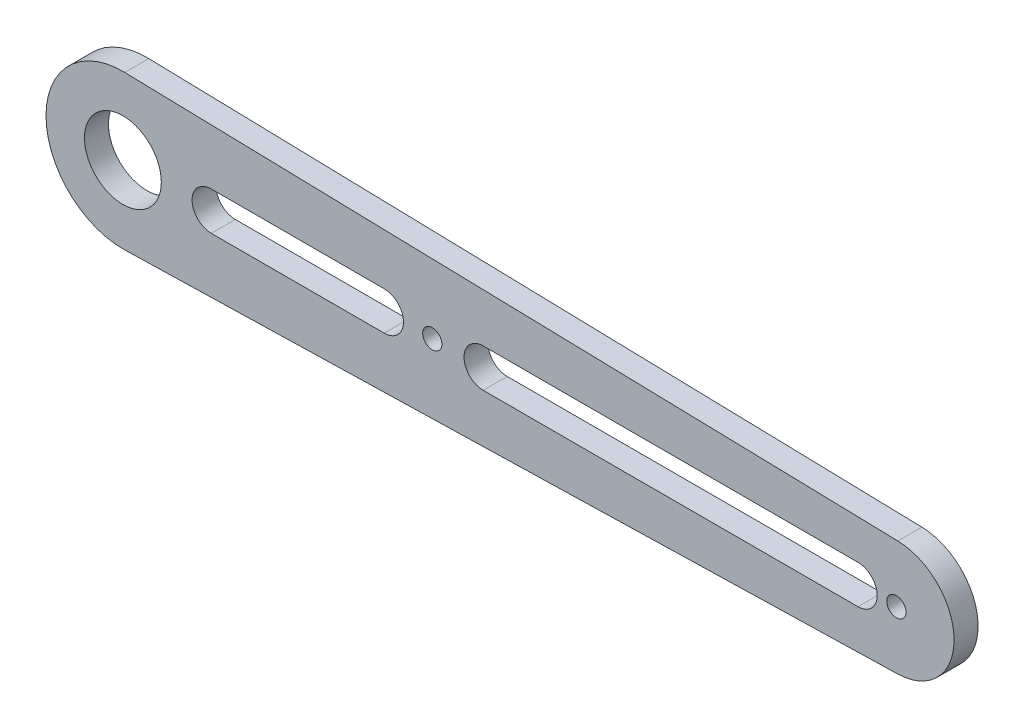
ISO-10303-21;
HEADER;
FILE_DESCRIPTION(('STEP AP214'),'2;1');
FILE_NAME('part.step','',(''),(''),'','','');
FILE_SCHEMA(('AUTOMOTIVE_DESIGN { 1 0 10303 214 1 1 1 1 }'));
ENDSEC;
DATA;
#1=APPLICATION_CONTEXT('core data for automotive mechanical design processes');
#2=APPLICATION_PROTOCOL_DEFINITION('international standard','automotive_design',2000,#1);
#3=PRODUCT_CONTEXT('',#1,'mechanical');
#4=PRODUCT('Part','Part','',(#3));
#5=PRODUCT_RELATED_PRODUCT_CATEGORY('part','',(#4));
#6=PRODUCT_DEFINITION_FORMATION('','',#4);
#7=PRODUCT_DEFINITION_CONTEXT('part definition',#1,'design');
#8=PRODUCT_DEFINITION('design','',#6,#7);
#9=PRODUCT_DEFINITION_SHAPE('','',#8);
#10=(LENGTH_UNIT() NAMED_UNIT(*) SI_UNIT(.MILLI.,.METRE.));
#11=(NAMED_UNIT(*) PLANE_ANGLE_UNIT() SI_UNIT($,.RADIAN.));
#12=(NAMED_UNIT(*) SI_UNIT($,.STERADIAN.) SOLID_ANGLE_UNIT());
#13=UNCERTAINTY_MEASURE_WITH_UNIT(LENGTH_MEASURE(1.E-05),#10,'distance_accuracy_value','');
#14=(GEOMETRIC_REPRESENTATION_CONTEXT(3) GLOBAL_UNCERTAINTY_ASSIGNED_CONTEXT((#13)) GLOBAL_UNIT_ASSIGNED_CONTEXT((#10,
#11,#12)) REPRESENTATION_CONTEXT('',''));
#15=CARTESIAN_POINT('',(0.,0.,0.));
#16=DIRECTION('',(0.,0.,1.));
#17=DIRECTION('',(1.,0.,0.));
#18=AXIS2_PLACEMENT_3D('',#15,#16,#17);
#19=CARTESIAN_POINT('',(0.397515527950314,-15.995061156652,5.));
#20=DIRECTION('',(-0.0248447204968946,0.999691322290752,0.));
#21=DIRECTION('',(-0.999691322290752,-0.0248447204968946,0.));
#22=AXIS2_PLACEMENT_3D('',#19,#20,#21);
#23=PLANE('',#22);
#24=DIRECTION('',(0.999691322290752,0.0248447204968946,0.));
#25=VECTOR('',#24,1.);
#26=CARTESIAN_POINT('',(0.397515527950314,-15.995061156652,0.));
#27=LINE('',#26,#25);
#28=CARTESIAN_POINT('',(0.397515527950314,-15.995061156652,0.));
#29=VERTEX_POINT('',#28);
#30=CARTESIAN_POINT('',(161.298136645963,-11.996295867489,0.));
#31=VERTEX_POINT('',#30);
#32=EDGE_CURVE('E190',#29,#31,#27,.T.);
#33=ORIENTED_EDGE('',*,*,#32,.T.);
#34=DIRECTION('',(0.,0.,-1.));
#35=VECTOR('',#34,1.);
#36=CARTESIAN_POINT('',(161.298136645963,-11.996295867489,5.));
#37=LINE('',#36,#35);
#38=CARTESIAN_POINT('',(161.298136645963,-11.996295867489,5.));
#39=VERTEX_POINT('',#38);
#40=EDGE_CURVE('E11',#39,#31,#37,.T.);
#41=ORIENTED_EDGE('',*,*,#40,.F.);
#42=DIRECTION('',(0.999691322290752,0.0248447204968946,0.));
#43=VECTOR('',#42,1.);
#44=CARTESIAN_POINT('',(0.397515527950314,-15.995061156652,5.));
#45=LINE('',#44,#43);
#46=CARTESIAN_POINT('',(0.397515527950314,-15.995061156652,5.));
#47=VERTEX_POINT('',#46);
#48=EDGE_CURVE('E143',#47,#39,#45,.T.);
#49=ORIENTED_EDGE('',*,*,#48,.F.);
#50=DIRECTION('',(0.,0.,-1.));
#51=VECTOR('',#50,1.);
#52=CARTESIAN_POINT('',(0.397515527950314,-15.995061156652,5.));
#53=LINE('',#52,#51);
#54=EDGE_CURVE('E197',#47,#29,#53,.T.);
#55=ORIENTED_EDGE('',*,*,#54,.T.);
#56=EDGE_LOOP('',(#33,#41,#49,#55));
#57=FACE_BOUND('',#56,.T.);
#58=ADVANCED_FACE('F38',(#57),#23,.F.);
#59=CARTESIAN_POINT('',(161.,0.,5.));
#60=DIRECTION('',(0.,0.,-1.));
#61=DIRECTION('',(-1.,0.,0.));
#62=AXIS2_PLACEMENT_3D('',#59,#60,#61);
#63=CYLINDRICAL_SURFACE('',#62,12.);
#64=CARTESIAN_POINT('',(161.,0.,0.));
#65=DIRECTION('',(0.,0.,1.));
#66=DIRECTION('',(1.,0.,0.));
#67=AXIS2_PLACEMENT_3D('',#64,#65,#66);
#68=CIRCLE('',#67,12.);
#69=CARTESIAN_POINT('',(161.298136645963,11.996295867489,0.));
#70=VERTEX_POINT('',#69);
#71=EDGE_CURVE('E148',#31,#70,#68,.T.);
#72=ORIENTED_EDGE('',*,*,#71,.T.);
#73=DIRECTION('',(0.,0.,-1.));
#74=VECTOR('',#73,1.);
#75=CARTESIAN_POINT('',(161.298136645963,11.996295867489,5.));
#76=LINE('',#75,#74);
#77=CARTESIAN_POINT('',(161.298136645963,11.996295867489,5.));
#78=VERTEX_POINT('',#77);
#79=EDGE_CURVE('E48',#78,#70,#76,.T.);
#80=ORIENTED_EDGE('',*,*,#79,.F.);
#81=CARTESIAN_POINT('',(161.,0.,5.));
#82=DIRECTION('',(0.,0.,1.));
#83=DIRECTION('',(1.,0.,0.));
#84=AXIS2_PLACEMENT_3D('',#81,#82,#83);
#85=CIRCLE('',#84,12.);
#86=EDGE_CURVE('E137',#39,#78,#85,.T.);
#87=ORIENTED_EDGE('',*,*,#86,.F.);
#88=ORIENTED_EDGE('',*,*,#40,.T.);
#89=EDGE_LOOP('',(#72,#80,#87,#88));
#90=FACE_BOUND('',#89,.T.);
#91=ADVANCED_FACE('F147',(#90),#63,.T.);
#92=CARTESIAN_POINT('',(0.397515527950314,15.995061156652,5.));
#93=DIRECTION('',(-0.0248447204968946,-0.999691322290752,0.));
#94=DIRECTION('',(0.999691322290752,-0.0248447204968946,0.));
#95=AXIS2_PLACEMENT_3D('',#92,#93,#94);
#96=PLANE('',#95);
#97=DIRECTION('',(-0.999691322290752,0.0248447204968946,0.));
#98=VECTOR('',#97,1.);
#99=CARTESIAN_POINT('',(0.397515527950314,15.995061156652,0.));
#100=LINE('',#99,#98);
#101=CARTESIAN_POINT('',(0.397515527950314,15.995061156652,0.));
#102=VERTEX_POINT('',#101);
#103=EDGE_CURVE('E98',#70,#102,#100,.T.);
#104=ORIENTED_EDGE('',*,*,#103,.T.);
#105=DIRECTION('',(0.,0.,-1.));
#106=VECTOR('',#105,1.);
#107=CARTESIAN_POINT('',(0.397515527950314,15.995061156652,5.));
#108=LINE('',#107,#106);
#109=CARTESIAN_POINT('',(0.397515527950314,15.995061156652,5.));
#110=VERTEX_POINT('',#109);
#111=EDGE_CURVE('E149',#110,#102,#108,.T.);
#112=ORIENTED_EDGE('',*,*,#111,.F.);
#113=DIRECTION('',(-0.999691322290752,0.0248447204968946,0.));
#114=VECTOR('',#113,1.);
#115=CARTESIAN_POINT('',(0.397515527950314,15.995061156652,5.));
#116=LINE('',#115,#114);
#117=EDGE_CURVE('E141',#78,#110,#116,.T.);
#118=ORIENTED_EDGE('',*,*,#117,.F.);
#119=ORIENTED_EDGE('',*,*,#79,.T.);
#120=EDGE_LOOP('',(#104,#112,#118,#119));
#121=FACE_BOUND('',#120,.T.);
#122=ADVANCED_FACE('F151',(#121),#96,.F.);
#123=CARTESIAN_POINT('',(54.4,0.,5.));
#124=DIRECTION('',(0.,0.,-1.));
#125=DIRECTION('',(-1.,0.,0.));
#126=AXIS2_PLACEMENT_3D('',#123,#124,#125);
#127=CYLINDRICAL_SURFACE('',#126,4.);
#128=CARTESIAN_POINT('',(54.4,0.,0.));
#129=DIRECTION('',(0.,0.,1.));
#130=DIRECTION('',(1.,0.,0.));
#131=AXIS2_PLACEMENT_3D('',#128,#129,#130);
#132=CIRCLE('',#131,4.);
#133=CARTESIAN_POINT('',(54.4,-4.,0.));
#134=VERTEX_POINT('',#133);
#135=CARTESIAN_POINT('',(54.4,4.,0.));
#136=VERTEX_POINT('',#135);
#137=EDGE_CURVE('E172',#134,#136,#132,.T.);
#138=ORIENTED_EDGE('',*,*,#137,.F.);
#139=DIRECTION('',(0.,0.,-1.));
#140=VECTOR('',#139,1.);
#141=CARTESIAN_POINT('',(54.4,-4.,5.));
#142=LINE('',#141,#140);
#143=CARTESIAN_POINT('',(54.4,-4.,5.));
#144=VERTEX_POINT('',#143);
#145=EDGE_CURVE('E199',#144,#134,#142,.T.);
#146=ORIENTED_EDGE('',*,*,#145,.F.);
#147=CARTESIAN_POINT('',(54.4,0.,5.));
#148=DIRECTION('',(0.,0.,1.));
#149=DIRECTION('',(1.,0.,0.));
#150=AXIS2_PLACEMENT_3D('',#147,#148,#149);
#151=CIRCLE('',#150,4.);
#152=CARTESIAN_POINT('',(54.4,4.,5.));
#153=VERTEX_POINT('',#152);
#154=EDGE_CURVE('E234',#144,#153,#151,.T.);
#155=ORIENTED_EDGE('',*,*,#154,.T.);
#156=DIRECTION('',(0.,0.,-1.));
#157=VECTOR('',#156,1.);
#158=CARTESIAN_POINT('',(54.4,4.,5.));
#159=LINE('',#158,#157);
#160=EDGE_CURVE('E201',#153,#136,#159,.T.);
#161=ORIENTED_EDGE('',*,*,#160,.T.);
#162=EDGE_LOOP('',(#138,#146,#155,#161));
#163=FACE_BOUND('',#162,.T.);
#164=ADVANCED_FACE('F300',(#163),#127,.F.);
#165=CARTESIAN_POINT('',(0.,-4.,5.));
#166=DIRECTION('',(0.,1.,0.));
#167=DIRECTION('',(0.,0.,1.));
#168=AXIS2_PLACEMENT_3D('',#165,#166,#167);
#169=PLANE('',#168);
#170=DIRECTION('',(1.,0.,0.));
#171=VECTOR('',#170,1.);
#172=CARTESIAN_POINT('',(0.,-4.,0.));
#173=LINE('',#172,#171);
#174=CARTESIAN_POINT('',(18.4,-4.,0.));
#175=VERTEX_POINT('',#174);
#176=EDGE_CURVE('E175',#175,#134,#173,.T.);
#177=ORIENTED_EDGE('',*,*,#176,.F.);
#178=DIRECTION('',(0.,0.,-1.));
#179=VECTOR('',#178,1.);
#180=CARTESIAN_POINT('',(18.4,-4.,5.));
#181=LINE('',#180,#179);
#182=CARTESIAN_POINT('',(18.4,-4.,5.));
#183=VERTEX_POINT('',#182);
#184=EDGE_CURVE('E205',#183,#175,#181,.T.);
#185=ORIENTED_EDGE('',*,*,#184,.F.);
#186=DIRECTION('',(1.,0.,0.));
#187=VECTOR('',#186,1.);
#188=CARTESIAN_POINT('',(0.,-4.,5.));
#189=LINE('',#188,#187);
#190=EDGE_CURVE('E244',#183,#144,#189,.T.);
#191=ORIENTED_EDGE('',*,*,#190,.T.);
#192=ORIENTED_EDGE('',*,*,#145,.T.);
#193=EDGE_LOOP('',(#177,#185,#191,#192));
#194=FACE_BOUND('',#193,.T.);
#195=ADVANCED_FACE('F296',(#194),#169,.T.);
#196=CARTESIAN_POINT('',(18.4,0.,5.));
#197=DIRECTION('',(0.,0.,-1.));
#198=DIRECTION('',(-1.,0.,0.));
#199=AXIS2_PLACEMENT_3D('',#196,#197,#198);
#200=CYLINDRICAL_SURFACE('',#199,4.);
#201=CARTESIAN_POINT('',(18.4,0.,0.));
#202=DIRECTION('',(0.,0.,1.));
#203=DIRECTION('',(1.,0.,0.));
#204=AXIS2_PLACEMENT_3D('',#201,#202,#203);
#205=CIRCLE('',#204,4.);
#206=CARTESIAN_POINT('',(18.4,4.,0.));
#207=VERTEX_POINT('',#206);
#208=EDGE_CURVE('E178',#207,#175,#205,.T.);
#209=ORIENTED_EDGE('',*,*,#208,.F.);
#210=DIRECTION('',(0.,0.,-1.));
#211=VECTOR('',#210,1.);
#212=CARTESIAN_POINT('',(18.4,4.,5.));
#213=LINE('',#212,#211);
#214=CARTESIAN_POINT('',(18.4,4.,5.));
#215=VERTEX_POINT('',#214);
#216=EDGE_CURVE('E203',#215,#207,#213,.T.);
#217=ORIENTED_EDGE('',*,*,#216,.F.);
#218=CARTESIAN_POINT('',(18.4,0.,5.));
#219=DIRECTION('',(0.,0.,1.));
#220=DIRECTION('',(1.,0.,0.));
#221=AXIS2_PLACEMENT_3D('',#218,#219,#220);
#222=CIRCLE('',#221,4.);
#223=EDGE_CURVE('E247',#215,#183,#222,.T.);
#224=ORIENTED_EDGE('',*,*,#223,.T.);
#225=ORIENTED_EDGE('',*,*,#184,.T.);
#226=EDGE_LOOP('',(#209,#217,#224,#225));
#227=FACE_BOUND('',#226,.T.);
#228=ADVANCED_FACE('F293',(#227),#200,.F.);
#229=CARTESIAN_POINT('',(153.,0.,5.));
#230=DIRECTION('',(0.,0.,-1.));
#231=DIRECTION('',(-1.,0.,0.));
#232=AXIS2_PLACEMENT_3D('',#229,#230,#231);
#233=CYLINDRICAL_SURFACE('',#232,4.);
#234=CARTESIAN_POINT('',(153.,0.,0.));
#235=DIRECTION('',(0.,0.,1.));
#236=DIRECTION('',(1.,0.,0.));
#237=AXIS2_PLACEMENT_3D('',#234,#235,#236);
#238=CIRCLE('',#237,4.);
#239=CARTESIAN_POINT('',(153.,-4.,0.));
#240=VERTEX_POINT('',#239);
#241=CARTESIAN_POINT('',(153.,4.,0.));
#242=VERTEX_POINT('',#241);
#243=EDGE_CURVE('E160',#240,#242,#238,.T.);
#244=ORIENTED_EDGE('',*,*,#243,.F.);
#245=DIRECTION('',(0.,0.,-1.));
#246=VECTOR('',#245,1.);
#247=CARTESIAN_POINT('',(153.,-4.,5.));
#248=LINE('',#247,#246);
#249=CARTESIAN_POINT('',(153.,-4.,5.));
#250=VERTEX_POINT('',#249);
#251=EDGE_CURVE('E42',#250,#240,#248,.T.);
#252=ORIENTED_EDGE('',*,*,#251,.F.);
#253=CARTESIAN_POINT('',(153.,0.,5.));
#254=DIRECTION('',(0.,0.,1.));
#255=DIRECTION('',(1.,0.,0.));
#256=AXIS2_PLACEMENT_3D('',#253,#254,#255);
#257=CIRCLE('',#256,4.);
#258=CARTESIAN_POINT('',(153.,4.,5.));
#259=VERTEX_POINT('',#258);
#260=EDGE_CURVE('E238',#250,#259,#257,.T.);
#261=ORIENTED_EDGE('',*,*,#260,.T.);
#262=DIRECTION('',(0.,0.,-1.));
#263=VECTOR('',#262,1.);
#264=CARTESIAN_POINT('',(153.,4.,5.));
#265=LINE('',#264,#263);
#266=EDGE_CURVE('E153',#259,#242,#265,.T.);
#267=ORIENTED_EDGE('',*,*,#266,.T.);
#268=EDGE_LOOP('',(#244,#252,#261,#267));
#269=FACE_BOUND('',#268,.T.);
#270=ADVANCED_FACE('F220',(#269),#233,.F.);
#271=CARTESIAN_POINT('',(0.,-4.,5.));
#272=DIRECTION('',(0.,1.,0.));
#273=DIRECTION('',(0.,0.,1.));
#274=AXIS2_PLACEMENT_3D('',#271,#272,#273);
#275=PLANE('',#274);
#276=DIRECTION('',(1.,0.,0.));
#277=VECTOR('',#276,1.);
#278=CARTESIAN_POINT('',(0.,-4.,0.));
#279=LINE('',#278,#277);
#280=CARTESIAN_POINT('',(75.,-4.,0.));
#281=VERTEX_POINT('',#280);
#282=EDGE_CURVE('E163',#281,#240,#279,.T.);
#283=ORIENTED_EDGE('',*,*,#282,.F.);
#284=DIRECTION('',(0.,0.,-1.));
#285=VECTOR('',#284,1.);
#286=CARTESIAN_POINT('',(75.,-4.,5.));
#287=LINE('',#286,#285);
#288=CARTESIAN_POINT('',(75.,-4.,5.));
#289=VERTEX_POINT('',#288);
#290=EDGE_CURVE('E210',#289,#281,#287,.T.);
#291=ORIENTED_EDGE('',*,*,#290,.F.);
#292=DIRECTION('',(1.,0.,0.));
#293=VECTOR('',#292,1.);
#294=CARTESIAN_POINT('',(0.,-4.,5.));
#295=LINE('',#294,#293);
#296=EDGE_CURVE('E219',#289,#250,#295,.T.);
#297=ORIENTED_EDGE('',*,*,#296,.T.);
#298=ORIENTED_EDGE('',*,*,#251,.T.);
#299=EDGE_LOOP('',(#283,#291,#297,#298));
#300=FACE_BOUND('',#299,.T.);
#301=ADVANCED_FACE('F217',(#300),#275,.T.);
#302=CARTESIAN_POINT('',(75.,0.,5.));
#303=DIRECTION('',(0.,0.,-1.));
#304=DIRECTION('',(-1.,0.,0.));
#305=AXIS2_PLACEMENT_3D('',#302,#303,#304);
#306=CYLINDRICAL_SURFACE('',#305,4.);
#307=CARTESIAN_POINT('',(75.,0.,0.));
#308=DIRECTION('',(0.,0.,1.));
#309=DIRECTION('',(1.,0.,0.));
#310=AXIS2_PLACEMENT_3D('',#307,#308,#309);
#311=CIRCLE('',#310,4.);
#312=CARTESIAN_POINT('',(75.,4.,0.));
#313=VERTEX_POINT('',#312);
#314=EDGE_CURVE('E166',#313,#281,#311,.T.);
#315=ORIENTED_EDGE('',*,*,#314,.F.);
#316=DIRECTION('',(0.,0.,-1.));
#317=VECTOR('',#316,1.);
#318=CARTESIAN_POINT('',(75.,4.,5.));
#319=LINE('',#318,#317);
#320=CARTESIAN_POINT('',(75.,4.,5.));
#321=VERTEX_POINT('',#320);
#322=EDGE_CURVE('E209',#321,#313,#319,.T.);
#323=ORIENTED_EDGE('',*,*,#322,.F.);
#324=CARTESIAN_POINT('',(75.,0.,5.));
#325=DIRECTION('',(0.,0.,1.));
#326=DIRECTION('',(1.,0.,0.));
#327=AXIS2_PLACEMENT_3D('',#324,#325,#326);
#328=CIRCLE('',#327,4.);
#329=EDGE_CURVE('E229',#321,#289,#328,.T.);
#330=ORIENTED_EDGE('',*,*,#329,.T.);
#331=ORIENTED_EDGE('',*,*,#290,.T.);
#332=EDGE_LOOP('',(#315,#323,#330,#331));
#333=FACE_BOUND('',#332,.T.);
#334=ADVANCED_FACE('F226',(#333),#306,.F.);
#335=CARTESIAN_POINT('',(0.,0.,5.));
#336=DIRECTION('',(0.,0.,-1.));
#337=DIRECTION('',(-1.,0.,0.));
#338=AXIS2_PLACEMENT_3D('',#335,#336,#337);
#339=CYLINDRICAL_SURFACE('',#338,8.);
#340=CARTESIAN_POINT('',(0.,0.,5.));
#341=DIRECTION('',(0.,0.,1.));
#342=DIRECTION('',(1.,0.,0.));
#343=AXIS2_PLACEMENT_3D('',#340,#341,#342);
#344=CIRCLE('',#343,8.);
#345=CARTESIAN_POINT('',(8.,0.,5.));
#346=VERTEX_POINT('',#345);
#347=EDGE_CURVE('E255',#346,#346,#344,.T.);
#348=ORIENTED_EDGE('',*,*,#347,.T.);
#349=EDGE_LOOP('',(#348));
#350=FACE_BOUND('',#349,.T.);
#351=CARTESIAN_POINT('',(0.,0.,0.));
#352=DIRECTION('',(0.,0.,1.));
#353=DIRECTION('',(1.,0.,0.));
#354=AXIS2_PLACEMENT_3D('',#351,#352,#353);
#355=CIRCLE('',#354,8.);
#356=CARTESIAN_POINT('',(8.,0.,0.));
#357=VERTEX_POINT('',#356);
#358=EDGE_CURVE('E187',#357,#357,#355,.T.);
#359=ORIENTED_EDGE('',*,*,#358,.F.);
#360=EDGE_LOOP('',(#359));
#361=FACE_BOUND('',#360,.T.);
#362=ADVANCED_FACE('F259',(#350,#361),#339,.F.);
#363=CARTESIAN_POINT('',(161.,0.,5.));
#364=DIRECTION('',(0.,0.,-1.));
#365=DIRECTION('',(-1.,0.,0.));
#366=AXIS2_PLACEMENT_3D('',#363,#364,#365);
#367=CYLINDRICAL_SURFACE('',#366,1.99999999999994);
#368=CARTESIAN_POINT('',(161.,0.,5.));
#369=DIRECTION('',(0.,0.,1.));
#370=DIRECTION('',(1.,0.,0.));
#371=AXIS2_PLACEMENT_3D('',#368,#369,#370);
#372=CIRCLE('',#371,1.99999999999994);
#373=CARTESIAN_POINT('',(163.,0.,5.));
#374=VERTEX_POINT('',#373);
#375=EDGE_CURVE('E252',#374,#374,#372,.T.);
#376=ORIENTED_EDGE('',*,*,#375,.T.);
#377=EDGE_LOOP('',(#376));
#378=FACE_BOUND('',#377,.T.);
#379=CARTESIAN_POINT('',(161.,0.,0.));
#380=DIRECTION('',(0.,0.,1.));
#381=DIRECTION('',(1.,0.,0.));
#382=AXIS2_PLACEMENT_3D('',#379,#380,#381);
#383=CIRCLE('',#382,1.99999999999994);
#384=CARTESIAN_POINT('',(163.,0.,0.));
#385=VERTEX_POINT('',#384);
#386=EDGE_CURVE('E184',#385,#385,#383,.T.);
#387=ORIENTED_EDGE('',*,*,#386,.F.);
#388=EDGE_LOOP('',(#387));
#389=FACE_BOUND('',#388,.T.);
#390=ADVANCED_FACE('F285',(#378,#389),#367,.F.);
#391=CARTESIAN_POINT('',(0.,4.,5.));
#392=DIRECTION('',(0.,1.,0.));
#393=DIRECTION('',(0.,0.,1.));
#394=AXIS2_PLACEMENT_3D('',#391,#392,#393);
#395=PLANE('',#394);
#396=DIRECTION('',(1.,0.,0.));
#397=VECTOR('',#396,1.);
#398=CARTESIAN_POINT('',(0.,4.,0.));
#399=LINE('',#398,#397);
#400=EDGE_CURVE('E181',#207,#136,#399,.T.);
#401=ORIENTED_EDGE('',*,*,#400,.T.);
#402=ORIENTED_EDGE('',*,*,#160,.F.);
#403=DIRECTION('',(1.,0.,0.));
#404=VECTOR('',#403,1.);
#405=CARTESIAN_POINT('',(0.,4.,5.));
#406=LINE('',#405,#404);
#407=EDGE_CURVE('E250',#215,#153,#406,.T.);
#408=ORIENTED_EDGE('',*,*,#407,.F.);
#409=ORIENTED_EDGE('',*,*,#216,.T.);
#410=EDGE_LOOP('',(#401,#402,#408,#409));
#411=FACE_BOUND('',#410,.T.);
#412=ADVANCED_FACE('F288',(#411),#395,.F.);
#413=CARTESIAN_POINT('',(0.,4.,5.));
#414=DIRECTION('',(0.,1.,0.));
#415=DIRECTION('',(0.,0.,1.));
#416=AXIS2_PLACEMENT_3D('',#413,#414,#415);
#417=PLANE('',#416);
#418=DIRECTION('',(1.,0.,0.));
#419=VECTOR('',#418,1.);
#420=CARTESIAN_POINT('',(0.,4.,0.));
#421=LINE('',#420,#419);
#422=EDGE_CURVE('E169',#313,#242,#421,.T.);
#423=ORIENTED_EDGE('',*,*,#422,.T.);
#424=ORIENTED_EDGE('',*,*,#266,.F.);
#425=DIRECTION('',(1.,0.,0.));
#426=VECTOR('',#425,1.);
#427=CARTESIAN_POINT('',(0.,4.,5.));
#428=LINE('',#427,#426);
#429=EDGE_CURVE('E231',#321,#259,#428,.T.);
#430=ORIENTED_EDGE('',*,*,#429,.F.);
#431=ORIENTED_EDGE('',*,*,#322,.T.);
#432=EDGE_LOOP('',(#423,#424,#430,#431));
#433=FACE_BOUND('',#432,.T.);
#434=ADVANCED_FACE('F232',(#433),#417,.F.);
#435=CARTESIAN_POINT('',(64.4,0.,5.));
#436=DIRECTION('',(0.,0.,-1.));
#437=DIRECTION('',(-1.,0.,0.));
#438=AXIS2_PLACEMENT_3D('',#435,#436,#437);
#439=CYLINDRICAL_SURFACE('',#438,2.);
#440=CARTESIAN_POINT('',(64.4,0.,5.));
#441=DIRECTION('',(0.,0.,1.));
#442=DIRECTION('',(1.,0.,0.));
#443=AXIS2_PLACEMENT_3D('',#440,#441,#442);
#444=CIRCLE('',#443,2.);
#445=CARTESIAN_POINT('',(66.4,0.,5.));
#446=VERTEX_POINT('',#445);
#447=EDGE_CURVE('E196',#446,#446,#444,.T.);
#448=ORIENTED_EDGE('',*,*,#447,.T.);
#449=EDGE_LOOP('',(#448));
#450=FACE_BOUND('',#449,.T.);
#451=CARTESIAN_POINT('',(64.4,0.,0.));
#452=DIRECTION('',(0.,0.,1.));
#453=DIRECTION('',(1.,0.,0.));
#454=AXIS2_PLACEMENT_3D('',#451,#452,#453);
#455=CIRCLE('',#454,2.);
#456=CARTESIAN_POINT('',(66.4,0.,0.));
#457=VERTEX_POINT('',#456);
#458=EDGE_CURVE('E157',#457,#457,#455,.T.);
#459=ORIENTED_EDGE('',*,*,#458,.F.);
#460=EDGE_LOOP('',(#459));
#461=FACE_BOUND('',#460,.T.);
#462=ADVANCED_FACE('F40',(#450,#461),#439,.F.);
#463=CARTESIAN_POINT('',(0.,0.,5.));
#464=DIRECTION('',(0.,0.,-1.));
#465=DIRECTION('',(-1.,0.,0.));
#466=AXIS2_PLACEMENT_3D('',#463,#464,#465);
#467=CYLINDRICAL_SURFACE('',#466,16.);
#468=CARTESIAN_POINT('',(0.,0.,0.));
#469=DIRECTION('',(0.,0.,1.));
#470=DIRECTION('',(1.,0.,0.));
#471=AXIS2_PLACEMENT_3D('',#468,#469,#470);
#472=CIRCLE('',#471,16.);
#473=EDGE_CURVE('E104',#102,#29,#472,.T.);
#474=ORIENTED_EDGE('',*,*,#473,.T.);
#475=ORIENTED_EDGE('',*,*,#54,.F.);
#476=CARTESIAN_POINT('',(0.,0.,5.));
#477=DIRECTION('',(0.,0.,1.));
#478=DIRECTION('',(1.,0.,0.));
#479=AXIS2_PLACEMENT_3D('',#476,#477,#478);
#480=CIRCLE('',#479,16.);
#481=EDGE_CURVE('E57',#110,#47,#480,.T.);
#482=ORIENTED_EDGE('',*,*,#481,.F.);
#483=ORIENTED_EDGE('',*,*,#111,.T.);
#484=EDGE_LOOP('',(#474,#475,#482,#483));
#485=FACE_BOUND('',#484,.T.);
#486=ADVANCED_FACE('F263',(#485),#467,.T.);
#487=CARTESIAN_POINT('',(0.,0.,5.));
#488=DIRECTION('',(0.,0.,1.));
#489=DIRECTION('',(1.,0.,0.));
#490=AXIS2_PLACEMENT_3D('',#487,#488,#489);
#491=PLANE('',#490);
#492=ORIENTED_EDGE('',*,*,#447,.F.);
#493=EDGE_LOOP('',(#492));
#494=FACE_BOUND('',#493,.T.);
#495=ORIENTED_EDGE('',*,*,#260,.F.);
#496=ORIENTED_EDGE('',*,*,#296,.F.);
#497=ORIENTED_EDGE('',*,*,#329,.F.);
#498=ORIENTED_EDGE('',*,*,#429,.T.);
#499=EDGE_LOOP('',(#495,#496,#497,#498));
#500=FACE_BOUND('',#499,.T.);
#501=ORIENTED_EDGE('',*,*,#154,.F.);
#502=ORIENTED_EDGE('',*,*,#190,.F.);
#503=ORIENTED_EDGE('',*,*,#223,.F.);
#504=ORIENTED_EDGE('',*,*,#407,.T.);
#505=EDGE_LOOP('',(#501,#502,#503,#504));
#506=FACE_BOUND('',#505,.T.);
#507=ORIENTED_EDGE('',*,*,#375,.F.);
#508=EDGE_LOOP('',(#507));
#509=FACE_BOUND('',#508,.T.);
#510=ORIENTED_EDGE('',*,*,#347,.F.);
#511=EDGE_LOOP('',(#510));
#512=FACE_BOUND('',#511,.T.);
#513=ORIENTED_EDGE('',*,*,#48,.T.);
#514=ORIENTED_EDGE('',*,*,#86,.T.);
#515=ORIENTED_EDGE('',*,*,#117,.T.);
#516=ORIENTED_EDGE('',*,*,#481,.T.);
#517=EDGE_LOOP('',(#513,#514,#515,#516));
#518=FACE_BOUND('',#517,.T.);
#519=ADVANCED_FACE('F139',(#494,#500,#506,#509,#512,#518),#491,.T.);
#520=CARTESIAN_POINT('',(0.,0.,0.));
#521=DIRECTION('',(0.,0.,1.));
#522=DIRECTION('',(1.,0.,0.));
#523=AXIS2_PLACEMENT_3D('',#520,#521,#522);
#524=PLANE('',#523);
#525=ORIENTED_EDGE('',*,*,#458,.T.);
#526=EDGE_LOOP('',(#525));
#527=FACE_BOUND('',#526,.T.);
#528=ORIENTED_EDGE('',*,*,#243,.T.);
#529=ORIENTED_EDGE('',*,*,#422,.F.);
#530=ORIENTED_EDGE('',*,*,#314,.T.);
#531=ORIENTED_EDGE('',*,*,#282,.T.);
#532=EDGE_LOOP('',(#528,#529,#530,#531));
#533=FACE_BOUND('',#532,.T.);
#534=ORIENTED_EDGE('',*,*,#137,.T.);
#535=ORIENTED_EDGE('',*,*,#400,.F.);
#536=ORIENTED_EDGE('',*,*,#208,.T.);
#537=ORIENTED_EDGE('',*,*,#176,.T.);
#538=EDGE_LOOP('',(#534,#535,#536,#537));
#539=FACE_BOUND('',#538,.T.);
#540=ORIENTED_EDGE('',*,*,#386,.T.);
#541=EDGE_LOOP('',(#540));
#542=FACE_BOUND('',#541,.T.);
#543=ORIENTED_EDGE('',*,*,#358,.T.);
#544=EDGE_LOOP('',(#543));
#545=FACE_BOUND('',#544,.T.);
#546=ORIENTED_EDGE('',*,*,#32,.F.);
#547=ORIENTED_EDGE('',*,*,#473,.F.);
#548=ORIENTED_EDGE('',*,*,#103,.F.);
#549=ORIENTED_EDGE('',*,*,#71,.F.);
#550=EDGE_LOOP('',(#546,#547,#548,#549));
#551=FACE_BOUND('',#550,.T.);
#552=ADVANCED_FACE('F224',(#527,#533,#539,#542,#545,#551),#524,.F.);
#553=CLOSED_SHELL('',(#58,#91,#122,#164,#195,#228,#270,#301,#334,#362,#390,#412,#434,#462,#486,
#519,#552));
#554=MANIFOLD_SOLID_BREP('B2',#553);
#555=ADVANCED_BREP_SHAPE_REPRESENTATION('',(#18,#554),#14);
#556=SHAPE_DEFINITION_REPRESENTATION(#9,#555);
ENDSEC;
END-ISO-10303-21;
